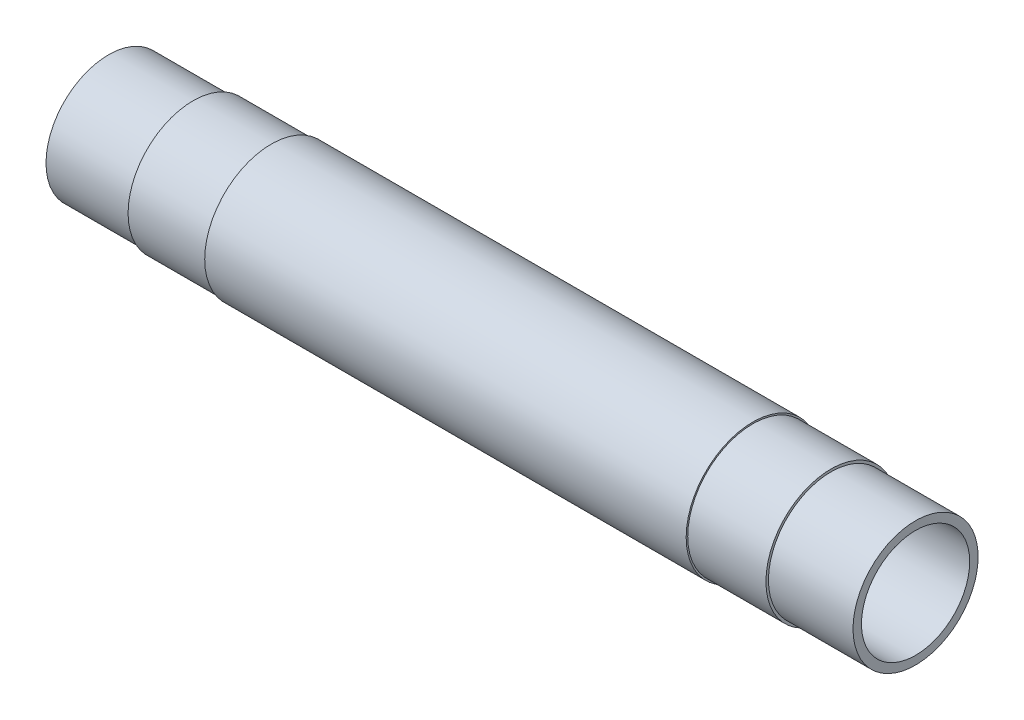
ISO-10303-21;
HEADER;
FILE_DESCRIPTION(('STEP AP214'),'2;1');
FILE_NAME('part.step','',(''),(''),'','','');
FILE_SCHEMA(('AUTOMOTIVE_DESIGN { 1 0 10303 214 1 1 1 1 }'));
ENDSEC;
DATA;
#1=APPLICATION_CONTEXT('core data for automotive mechanical design processes');
#2=APPLICATION_PROTOCOL_DEFINITION('international standard','automotive_design',2000,#1);
#3=PRODUCT_CONTEXT('',#1,'mechanical');
#4=PRODUCT('Part','Part','',(#3));
#5=PRODUCT_RELATED_PRODUCT_CATEGORY('part','',(#4));
#6=PRODUCT_DEFINITION_FORMATION('','',#4);
#7=PRODUCT_DEFINITION_CONTEXT('part definition',#1,'design');
#8=PRODUCT_DEFINITION('design','',#6,#7);
#9=PRODUCT_DEFINITION_SHAPE('','',#8);
#10=(LENGTH_UNIT() NAMED_UNIT(*) SI_UNIT(.MILLI.,.METRE.));
#11=(NAMED_UNIT(*) PLANE_ANGLE_UNIT() SI_UNIT($,.RADIAN.));
#12=(NAMED_UNIT(*) SI_UNIT($,.STERADIAN.) SOLID_ANGLE_UNIT());
#13=UNCERTAINTY_MEASURE_WITH_UNIT(LENGTH_MEASURE(1.E-05),#10,'distance_accuracy_value','');
#14=(GEOMETRIC_REPRESENTATION_CONTEXT(3) GLOBAL_UNCERTAINTY_ASSIGNED_CONTEXT((#13)) GLOBAL_UNIT_ASSIGNED_CONTEXT((#10,
#11,#12)) REPRESENTATION_CONTEXT('',''));
#15=CARTESIAN_POINT('',(0.,0.,0.));
#16=DIRECTION('',(0.,0.,1.));
#17=DIRECTION('',(1.,0.,0.));
#18=AXIS2_PLACEMENT_3D('',#15,#16,#17);
#19=CARTESIAN_POINT('',(-94.622748878547,0.,0.));
#20=DIRECTION('',(1.,0.,0.));
#21=DIRECTION('',(0.,0.,-1.));
#22=AXIS2_PLACEMENT_3D('',#19,#20,#21);
#23=CYLINDRICAL_SURFACE('',#22,10.65);
#24=CARTESIAN_POINT('',(-38.4801960972816,0.,0.));
#25=DIRECTION('',(-1.,0.,0.));
#26=DIRECTION('',(0.,0.,1.));
#27=AXIS2_PLACEMENT_3D('',#24,#25,#26);
#28=CIRCLE('',#27,10.65);
#29=CARTESIAN_POINT('',(-38.4801960972816,0.,10.65));
#30=VERTEX_POINT('',#29);
#31=EDGE_CURVE('E38',#30,#30,#28,.T.);
#32=ORIENTED_EDGE('',*,*,#31,.F.);
#33=EDGE_LOOP('',(#32));
#34=FACE_BOUND('',#33,.T.);
#35=CARTESIAN_POINT('',(38.4801960972816,0.,0.));
#36=DIRECTION('',(-1.,0.,0.));
#37=DIRECTION('',(0.,0.,1.));
#38=AXIS2_PLACEMENT_3D('',#35,#36,#37);
#39=CIRCLE('',#38,10.65);
#40=CARTESIAN_POINT('',(38.4801960972816,0.,10.65));
#41=VERTEX_POINT('',#40);
#42=EDGE_CURVE('E60',#41,#41,#39,.T.);
#43=ORIENTED_EDGE('',*,*,#42,.T.);
#44=EDGE_LOOP('',(#43));
#45=FACE_BOUND('',#44,.T.);
#46=ADVANCED_FACE('F32',(#34,#45),#23,.T.);
#47=CARTESIAN_POINT('',(-64.5000000000001,10.8660542945242,3.7654832450103));
#48=DIRECTION('',(1.,0.,0.));
#49=DIRECTION('',(0.,0.327433325653069,-0.944874286480361));
#50=AXIS2_PLACEMENT_3D('',#47,#48,#49);
#51=PLANE('',#50);
#52=CARTESIAN_POINT('',(-64.5000000000001,0.,0.));
#53=DIRECTION('',(1.,0.,0.));
#54=DIRECTION('',(0.,0.,-1.));
#55=AXIS2_PLACEMENT_3D('',#52,#53,#54);
#56=CIRCLE('',#55,8.65);
#57=CARTESIAN_POINT('',(-64.5000000000001,0.,-8.65));
#58=VERTEX_POINT('',#57);
#59=EDGE_CURVE('E10',#58,#58,#56,.F.);
#60=ORIENTED_EDGE('',*,*,#59,.F.);
#61=EDGE_LOOP('',(#60));
#62=FACE_BOUND('',#61,.T.);
#63=CARTESIAN_POINT('',(-64.5000000000001,0.,0.));
#64=DIRECTION('',(-1.,0.,0.));
#65=DIRECTION('',(0.,0.,1.));
#66=AXIS2_PLACEMENT_3D('',#63,#64,#65);
#67=CIRCLE('',#66,10.);
#68=CARTESIAN_POINT('',(-64.5000000000001,0.,10.));
#69=VERTEX_POINT('',#68);
#70=EDGE_CURVE('E42',#69,#69,#67,.T.);
#71=ORIENTED_EDGE('',*,*,#70,.T.);
#72=EDGE_LOOP('',(#71));
#73=FACE_BOUND('',#72,.T.);
#74=ADVANCED_FACE('F111',(#62,#73),#51,.F.);
#75=CARTESIAN_POINT('',(-94.622748878547,0.,0.));
#76=DIRECTION('',(1.,0.,0.));
#77=DIRECTION('',(0.,0.,-1.));
#78=AXIS2_PLACEMENT_3D('',#75,#76,#77);
#79=CYLINDRICAL_SURFACE('',#78,8.65);
#80=ORIENTED_EDGE('',*,*,#59,.T.);
#81=EDGE_LOOP('',(#80));
#82=FACE_BOUND('',#81,.T.);
#83=CARTESIAN_POINT('',(64.5000000000001,0.,0.));
#84=DIRECTION('',(1.,0.,0.));
#85=DIRECTION('',(0.,0.,-1.));
#86=AXIS2_PLACEMENT_3D('',#83,#84,#85);
#87=CIRCLE('',#86,8.65);
#88=CARTESIAN_POINT('',(64.5000000000001,0.,-8.65));
#89=VERTEX_POINT('',#88);
#90=EDGE_CURVE('E57',#89,#89,#87,.F.);
#91=ORIENTED_EDGE('',*,*,#90,.F.);
#92=EDGE_LOOP('',(#91));
#93=FACE_BOUND('',#92,.T.);
#94=ADVANCED_FACE('F116',(#82,#93),#79,.F.);
#95=CARTESIAN_POINT('',(-38.4801960972816,10.4,0.));
#96=DIRECTION('',(-1.,0.,0.));
#97=DIRECTION('',(0.,0.,1.));
#98=AXIS2_PLACEMENT_3D('',#95,#96,#97);
#99=PLANE('',#98);
#100=ORIENTED_EDGE('',*,*,#31,.T.);
#101=EDGE_LOOP('',(#100));
#102=FACE_BOUND('',#101,.T.);
#103=CARTESIAN_POINT('',(-38.4801960972816,0.,0.));
#104=DIRECTION('',(-1.,0.,0.));
#105=DIRECTION('',(0.,0.,1.));
#106=AXIS2_PLACEMENT_3D('',#103,#104,#105);
#107=CIRCLE('',#106,10.4);
#108=CARTESIAN_POINT('',(-38.4801960972816,0.,10.4));
#109=VERTEX_POINT('',#108);
#110=EDGE_CURVE('E54',#109,#109,#107,.T.);
#111=ORIENTED_EDGE('',*,*,#110,.F.);
#112=EDGE_LOOP('',(#111));
#113=FACE_BOUND('',#112,.T.);
#114=ADVANCED_FACE('F124',(#102,#113),#99,.T.);
#115=CARTESIAN_POINT('',(-1000.,0.,0.));
#116=DIRECTION('',(-1.,0.,0.));
#117=DIRECTION('',(0.,0.,1.));
#118=AXIS2_PLACEMENT_3D('',#115,#116,#117);
#119=CYLINDRICAL_SURFACE('',#118,10.);
#120=CARTESIAN_POINT('',(-50.9801960972815,0.,0.));
#121=DIRECTION('',(-1.,0.,0.));
#122=DIRECTION('',(0.,0.,1.));
#123=AXIS2_PLACEMENT_3D('',#120,#121,#122);
#124=CIRCLE('',#123,10.);
#125=CARTESIAN_POINT('',(-50.9801960972815,0.,10.));
#126=VERTEX_POINT('',#125);
#127=EDGE_CURVE('E46',#126,#126,#124,.T.);
#128=ORIENTED_EDGE('',*,*,#127,.T.);
#129=EDGE_LOOP('',(#128));
#130=FACE_BOUND('',#129,.T.);
#131=ORIENTED_EDGE('',*,*,#70,.F.);
#132=EDGE_LOOP('',(#131));
#133=FACE_BOUND('',#132,.T.);
#134=ADVANCED_FACE('F129',(#130,#133),#119,.T.);
#135=CARTESIAN_POINT('',(-50.9801960972816,10.,0.));
#136=DIRECTION('',(-1.,0.,0.));
#137=DIRECTION('',(0.,0.,1.));
#138=AXIS2_PLACEMENT_3D('',#135,#136,#137);
#139=PLANE('',#138);
#140=CARTESIAN_POINT('',(-50.9801960972815,0.,0.));
#141=DIRECTION('',(-1.,0.,0.));
#142=DIRECTION('',(0.,0.,1.));
#143=AXIS2_PLACEMENT_3D('',#140,#141,#142);
#144=CIRCLE('',#143,10.4);
#145=CARTESIAN_POINT('',(-50.9801960972815,0.,10.4));
#146=VERTEX_POINT('',#145);
#147=EDGE_CURVE('E51',#146,#146,#144,.T.);
#148=ORIENTED_EDGE('',*,*,#147,.T.);
#149=EDGE_LOOP('',(#148));
#150=FACE_BOUND('',#149,.T.);
#151=ORIENTED_EDGE('',*,*,#127,.F.);
#152=EDGE_LOOP('',(#151));
#153=FACE_BOUND('',#152,.T.);
#154=ADVANCED_FACE('F107',(#150,#153),#139,.T.);
#155=CARTESIAN_POINT('',(-1000.,0.,0.));
#156=DIRECTION('',(-1.,0.,0.));
#157=DIRECTION('',(0.,0.,1.));
#158=AXIS2_PLACEMENT_3D('',#155,#156,#157);
#159=CYLINDRICAL_SURFACE('',#158,10.4);
#160=ORIENTED_EDGE('',*,*,#110,.T.);
#161=EDGE_LOOP('',(#160));
#162=FACE_BOUND('',#161,.T.);
#163=ORIENTED_EDGE('',*,*,#147,.F.);
#164=EDGE_LOOP('',(#163));
#165=FACE_BOUND('',#164,.T.);
#166=ADVANCED_FACE('F98',(#162,#165),#159,.T.);
#167=CARTESIAN_POINT('',(64.5000000000001,10.8660542945242,3.7654832450103));
#168=DIRECTION('',(-1.,0.,0.));
#169=DIRECTION('',(0.,0.327433325653069,-0.944874286480361));
#170=AXIS2_PLACEMENT_3D('',#167,#168,#169);
#171=PLANE('',#170);
#172=ORIENTED_EDGE('',*,*,#90,.T.);
#173=EDGE_LOOP('',(#172));
#174=FACE_BOUND('',#173,.T.);
#175=CARTESIAN_POINT('',(64.5000000000001,0.,0.));
#176=DIRECTION('',(-1.,0.,0.));
#177=DIRECTION('',(0.,0.,1.));
#178=AXIS2_PLACEMENT_3D('',#175,#176,#177);
#179=CIRCLE('',#178,10.);
#180=CARTESIAN_POINT('',(64.5000000000001,0.,10.));
#181=VERTEX_POINT('',#180);
#182=EDGE_CURVE('E63',#181,#181,#179,.T.);
#183=ORIENTED_EDGE('',*,*,#182,.F.);
#184=EDGE_LOOP('',(#183));
#185=FACE_BOUND('',#184,.T.);
#186=ADVANCED_FACE('F96',(#174,#185),#171,.F.);
#187=CARTESIAN_POINT('',(38.4801960972816,10.4,0.));
#188=DIRECTION('',(1.,0.,0.));
#189=DIRECTION('',(0.,0.,1.));
#190=AXIS2_PLACEMENT_3D('',#187,#188,#189);
#191=PLANE('',#190);
#192=ORIENTED_EDGE('',*,*,#42,.F.);
#193=EDGE_LOOP('',(#192));
#194=FACE_BOUND('',#193,.T.);
#195=CARTESIAN_POINT('',(38.4801960972816,0.,0.));
#196=DIRECTION('',(-1.,0.,0.));
#197=DIRECTION('',(0.,0.,1.));
#198=AXIS2_PLACEMENT_3D('',#195,#196,#197);
#199=CIRCLE('',#198,10.4);
#200=CARTESIAN_POINT('',(38.4801960972816,0.,10.4));
#201=VERTEX_POINT('',#200);
#202=EDGE_CURVE('E72',#201,#201,#199,.T.);
#203=ORIENTED_EDGE('',*,*,#202,.T.);
#204=EDGE_LOOP('',(#203));
#205=FACE_BOUND('',#204,.T.);
#206=ADVANCED_FACE('F76',(#194,#205),#191,.T.);
#207=CARTESIAN_POINT('',(1000.,0.,0.));
#208=DIRECTION('',(1.,0.,0.));
#209=DIRECTION('',(0.,0.,1.));
#210=AXIS2_PLACEMENT_3D('',#207,#208,#209);
#211=CYLINDRICAL_SURFACE('',#210,10.);
#212=CARTESIAN_POINT('',(50.9801960972815,0.,0.));
#213=DIRECTION('',(-1.,0.,0.));
#214=DIRECTION('',(0.,0.,1.));
#215=AXIS2_PLACEMENT_3D('',#212,#213,#214);
#216=CIRCLE('',#215,10.);
#217=CARTESIAN_POINT('',(50.9801960972815,0.,10.));
#218=VERTEX_POINT('',#217);
#219=EDGE_CURVE('E66',#218,#218,#216,.T.);
#220=ORIENTED_EDGE('',*,*,#219,.F.);
#221=EDGE_LOOP('',(#220));
#222=FACE_BOUND('',#221,.T.);
#223=ORIENTED_EDGE('',*,*,#182,.T.);
#224=EDGE_LOOP('',(#223));
#225=FACE_BOUND('',#224,.T.);
#226=ADVANCED_FACE('F87',(#222,#225),#211,.T.);
#227=CARTESIAN_POINT('',(50.9801960972816,10.,0.));
#228=DIRECTION('',(1.,0.,0.));
#229=DIRECTION('',(0.,0.,1.));
#230=AXIS2_PLACEMENT_3D('',#227,#228,#229);
#231=PLANE('',#230);
#232=CARTESIAN_POINT('',(50.9801960972815,0.,0.));
#233=DIRECTION('',(-1.,0.,0.));
#234=DIRECTION('',(0.,0.,1.));
#235=AXIS2_PLACEMENT_3D('',#232,#233,#234);
#236=CIRCLE('',#235,10.4);
#237=CARTESIAN_POINT('',(50.9801960972815,0.,10.4));
#238=VERTEX_POINT('',#237);
#239=EDGE_CURVE('E69',#238,#238,#236,.T.);
#240=ORIENTED_EDGE('',*,*,#239,.F.);
#241=EDGE_LOOP('',(#240));
#242=FACE_BOUND('',#241,.T.);
#243=ORIENTED_EDGE('',*,*,#219,.T.);
#244=EDGE_LOOP('',(#243));
#245=FACE_BOUND('',#244,.T.);
#246=ADVANCED_FACE('F81',(#242,#245),#231,.T.);
#247=CARTESIAN_POINT('',(1000.,0.,0.));
#248=DIRECTION('',(1.,0.,0.));
#249=DIRECTION('',(0.,0.,1.));
#250=AXIS2_PLACEMENT_3D('',#247,#248,#249);
#251=CYLINDRICAL_SURFACE('',#250,10.4);
#252=ORIENTED_EDGE('',*,*,#202,.F.);
#253=EDGE_LOOP('',(#252));
#254=FACE_BOUND('',#253,.T.);
#255=ORIENTED_EDGE('',*,*,#239,.T.);
#256=EDGE_LOOP('',(#255));
#257=FACE_BOUND('',#256,.T.);
#258=ADVANCED_FACE('F78',(#254,#257),#251,.T.);
#259=CLOSED_SHELL('',(#46,#74,#94,#114,#134,#154,#166,#186,#206,#226,#246,#258));
#260=MANIFOLD_SOLID_BREP('B2',#259);
#261=ADVANCED_BREP_SHAPE_REPRESENTATION('',(#18,#260),#14);
#262=SHAPE_DEFINITION_REPRESENTATION(#9,#261);
ENDSEC;
END-ISO-10303-21;
